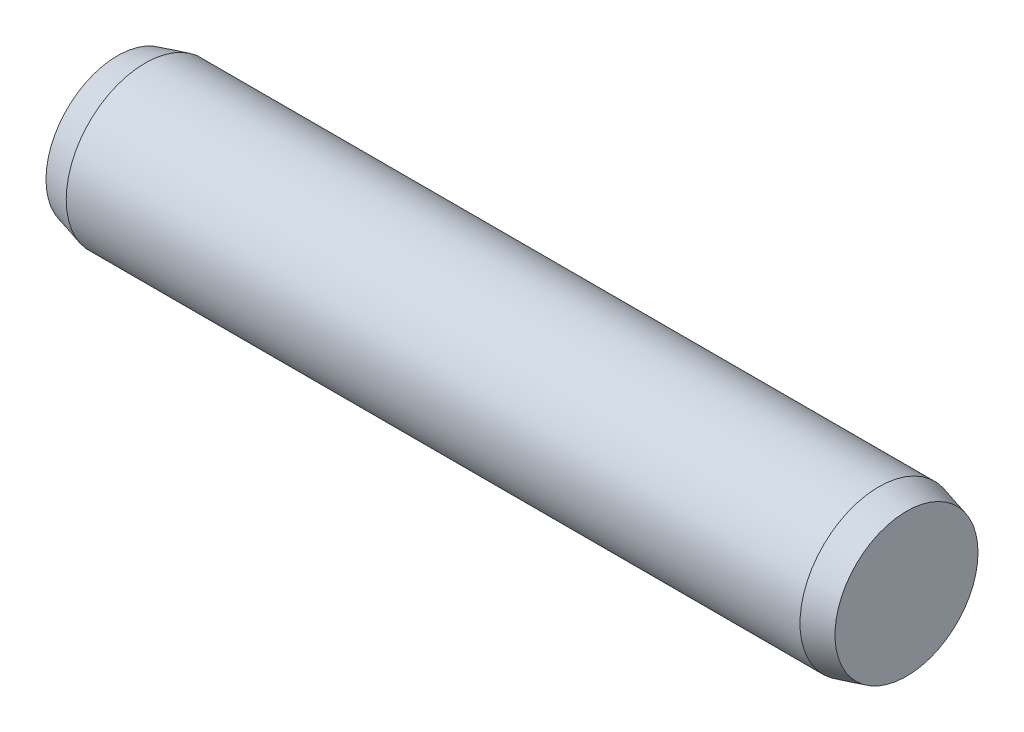
ISO-10303-21;
HEADER;
FILE_DESCRIPTION(('STEP AP214'),'2;1');
FILE_NAME('part.step','',(''),(''),'','','');
FILE_SCHEMA(('AUTOMOTIVE_DESIGN { 1 0 10303 214 1 1 1 1 }'));
ENDSEC;
DATA;
#1=APPLICATION_CONTEXT('core data for automotive mechanical design processes');
#2=APPLICATION_PROTOCOL_DEFINITION('international standard','automotive_design',2000,#1);
#3=PRODUCT_CONTEXT('',#1,'mechanical');
#4=PRODUCT('Part','Part','',(#3));
#5=PRODUCT_RELATED_PRODUCT_CATEGORY('part','',(#4));
#6=PRODUCT_DEFINITION_FORMATION('','',#4);
#7=PRODUCT_DEFINITION_CONTEXT('part definition',#1,'design');
#8=PRODUCT_DEFINITION('design','',#6,#7);
#9=PRODUCT_DEFINITION_SHAPE('','',#8);
#10=(LENGTH_UNIT() NAMED_UNIT(*) SI_UNIT(.MILLI.,.METRE.));
#11=(NAMED_UNIT(*) PLANE_ANGLE_UNIT() SI_UNIT($,.RADIAN.));
#12=(NAMED_UNIT(*) SI_UNIT($,.STERADIAN.) SOLID_ANGLE_UNIT());
#13=UNCERTAINTY_MEASURE_WITH_UNIT(LENGTH_MEASURE(1.E-05),#10,'distance_accuracy_value','');
#14=(GEOMETRIC_REPRESENTATION_CONTEXT(3) GLOBAL_UNCERTAINTY_ASSIGNED_CONTEXT((#13)) GLOBAL_UNIT_ASSIGNED_CONTEXT((#10,
#11,#12)) REPRESENTATION_CONTEXT('',''));
#15=CARTESIAN_POINT('',(0.,0.,0.));
#16=DIRECTION('',(0.,0.,1.));
#17=DIRECTION('',(1.,0.,0.));
#18=AXIS2_PLACEMENT_3D('',#15,#16,#17);
#19=CARTESIAN_POINT('',(-4.65,0.,0.));
#20=DIRECTION('',(1.,0.,0.));
#21=DIRECTION('',(0.,0.,-1.));
#22=AXIS2_PLACEMENT_3D('',#19,#20,#21);
#23=CYLINDRICAL_SURFACE('',#22,1.);
#24=CARTESIAN_POINT('',(-4.65,0.,0.));
#25=DIRECTION('',(-1.,0.,0.));
#26=DIRECTION('',(0.,0.,1.));
#27=AXIS2_PLACEMENT_3D('',#24,#25,#26);
#28=CIRCLE('',#27,1.);
#29=CARTESIAN_POINT('',(-4.65,0.,1.));
#30=VERTEX_POINT('',#29);
#31=EDGE_CURVE('E48',#30,#30,#28,.T.);
#32=ORIENTED_EDGE('',*,*,#31,.F.);
#33=EDGE_LOOP('',(#32));
#34=FACE_BOUND('',#33,.T.);
#35=CARTESIAN_POINT('',(4.65,0.,0.));
#36=DIRECTION('',(1.,0.,0.));
#37=DIRECTION('',(0.,0.,-1.));
#38=AXIS2_PLACEMENT_3D('',#35,#36,#37);
#39=CIRCLE('',#38,1.);
#40=CARTESIAN_POINT('',(4.65,0.,-1.));
#41=VERTEX_POINT('',#40);
#42=EDGE_CURVE('E10',#41,#41,#39,.T.);
#43=ORIENTED_EDGE('',*,*,#42,.F.);
#44=EDGE_LOOP('',(#43));
#45=FACE_BOUND('',#44,.T.);
#46=ADVANCED_FACE('F34',(#34,#45),#23,.T.);
#47=CARTESIAN_POINT('',(4.65,0.,0.));
#48=DIRECTION('',(-1.,0.,0.));
#49=DIRECTION('',(0.,0.,-1.));
#50=AXIS2_PLACEMENT_3D('',#47,#48,#49);
#51=CONICAL_SURFACE('',#50,1.,0.26179938779915);
#52=CARTESIAN_POINT('',(5.,0.,0.));
#53=DIRECTION('',(1.,0.,0.));
#54=DIRECTION('',(0.,0.,-1.));
#55=AXIS2_PLACEMENT_3D('',#52,#53,#54);
#56=CIRCLE('',#55,0.906217782649107);
#57=CARTESIAN_POINT('',(5.,0.,-0.906217782649107));
#58=VERTEX_POINT('',#57);
#59=EDGE_CURVE('E40',#58,#58,#56,.T.);
#60=ORIENTED_EDGE('',*,*,#59,.F.);
#61=EDGE_LOOP('',(#60));
#62=FACE_BOUND('',#61,.T.);
#63=ORIENTED_EDGE('',*,*,#42,.T.);
#64=EDGE_LOOP('',(#63));
#65=FACE_BOUND('',#64,.T.);
#66=ADVANCED_FACE('F58',(#62,#65),#51,.T.);
#67=CARTESIAN_POINT('',(5.,0.,0.));
#68=DIRECTION('',(1.,0.,0.));
#69=DIRECTION('',(0.,0.,-1.));
#70=AXIS2_PLACEMENT_3D('',#67,#68,#69);
#71=PLANE('',#70);
#72=ORIENTED_EDGE('',*,*,#59,.T.);
#73=EDGE_LOOP('',(#72));
#74=FACE_BOUND('',#73,.T.);
#75=ADVANCED_FACE('F62',(#74),#71,.T.);
#76=CARTESIAN_POINT('',(-4.65,0.,0.));
#77=DIRECTION('',(1.,0.,0.));
#78=DIRECTION('',(0.,0.,1.));
#79=AXIS2_PLACEMENT_3D('',#76,#77,#78);
#80=CONICAL_SURFACE('',#79,1.,0.26179938779915);
#81=CARTESIAN_POINT('',(-5.,0.,0.));
#82=DIRECTION('',(-1.,0.,0.));
#83=DIRECTION('',(0.,0.,1.));
#84=AXIS2_PLACEMENT_3D('',#81,#82,#83);
#85=CIRCLE('',#84,0.906217782649107);
#86=CARTESIAN_POINT('',(-5.,0.,0.906217782649107));
#87=VERTEX_POINT('',#86);
#88=EDGE_CURVE('E44',#87,#87,#85,.T.);
#89=ORIENTED_EDGE('',*,*,#88,.F.);
#90=EDGE_LOOP('',(#89));
#91=FACE_BOUND('',#90,.T.);
#92=ORIENTED_EDGE('',*,*,#31,.T.);
#93=EDGE_LOOP('',(#92));
#94=FACE_BOUND('',#93,.T.);
#95=ADVANCED_FACE('F54',(#91,#94),#80,.T.);
#96=CARTESIAN_POINT('',(-5.,0.,0.));
#97=DIRECTION('',(-1.,0.,0.));
#98=DIRECTION('',(0.,0.,1.));
#99=AXIS2_PLACEMENT_3D('',#96,#97,#98);
#100=PLANE('',#99);
#101=ORIENTED_EDGE('',*,*,#88,.T.);
#102=EDGE_LOOP('',(#101));
#103=FACE_BOUND('',#102,.T.);
#104=ADVANCED_FACE('F71',(#103),#100,.T.);
#105=CLOSED_SHELL('',(#46,#66,#75,#95,#104));
#106=MANIFOLD_SOLID_BREP('B2',#105);
#107=ADVANCED_BREP_SHAPE_REPRESENTATION('',(#18,#106),#14);
#108=SHAPE_DEFINITION_REPRESENTATION(#9,#107);
ENDSEC;
END-ISO-10303-21;
